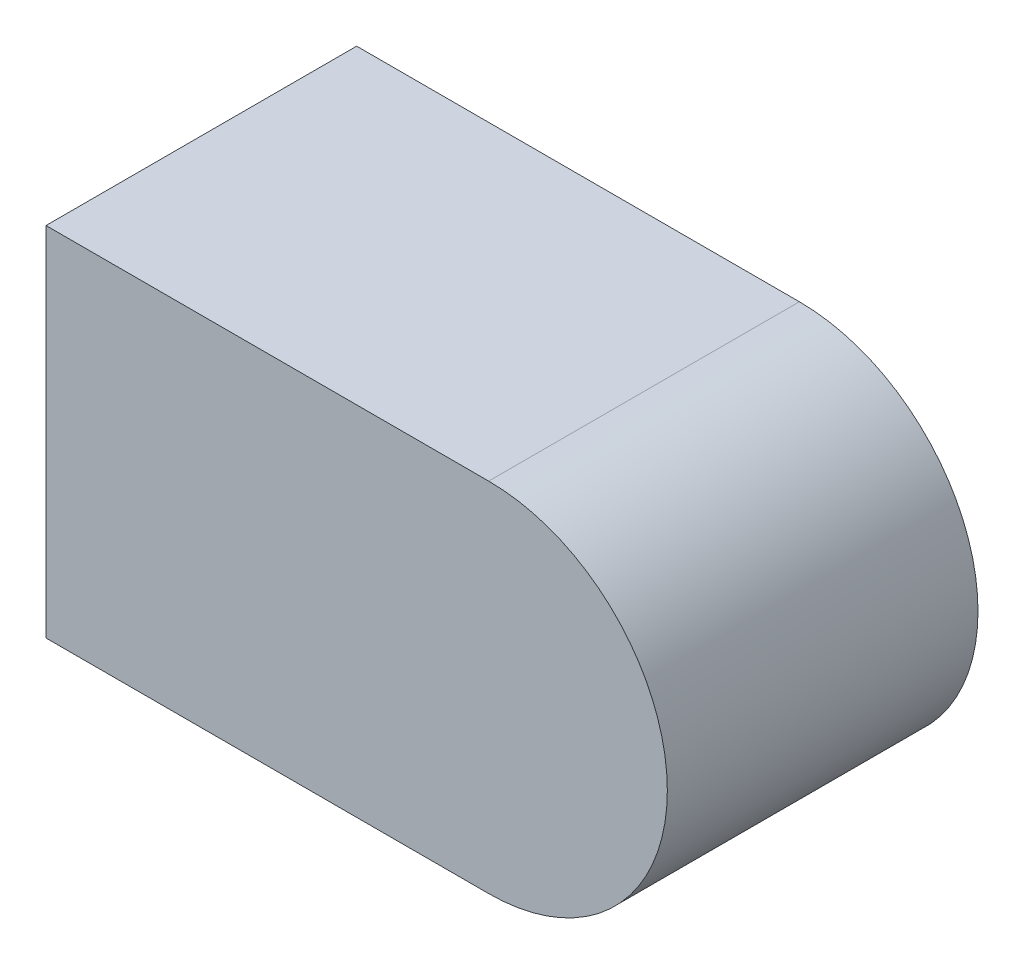
ISO-10303-21;
HEADER;
FILE_DESCRIPTION(('STEP AP214'),'2;1');
FILE_NAME('part.step','',(''),(''),'','','');
FILE_SCHEMA(('AUTOMOTIVE_DESIGN { 1 0 10303 214 1 1 1 1 }'));
ENDSEC;
DATA;
#1=APPLICATION_CONTEXT('core data for automotive mechanical design processes');
#2=APPLICATION_PROTOCOL_DEFINITION('international standard','automotive_design',2000,#1);
#3=PRODUCT_CONTEXT('',#1,'mechanical');
#4=PRODUCT('Part','Part','',(#3));
#5=PRODUCT_RELATED_PRODUCT_CATEGORY('part','',(#4));
#6=PRODUCT_DEFINITION_FORMATION('','',#4);
#7=PRODUCT_DEFINITION_CONTEXT('part definition',#1,'design');
#8=PRODUCT_DEFINITION('design','',#6,#7);
#9=PRODUCT_DEFINITION_SHAPE('','',#8);
#10=(LENGTH_UNIT() NAMED_UNIT(*) SI_UNIT(.MILLI.,.METRE.));
#11=(NAMED_UNIT(*) PLANE_ANGLE_UNIT() SI_UNIT($,.RADIAN.));
#12=(NAMED_UNIT(*) SI_UNIT($,.STERADIAN.) SOLID_ANGLE_UNIT());
#13=UNCERTAINTY_MEASURE_WITH_UNIT(LENGTH_MEASURE(1.E-05),#10,'distance_accuracy_value','');
#14=(GEOMETRIC_REPRESENTATION_CONTEXT(3) GLOBAL_UNCERTAINTY_ASSIGNED_CONTEXT((#13)) GLOBAL_UNIT_ASSIGNED_CONTEXT((#10,
#11,#12)) REPRESENTATION_CONTEXT('',''));
#15=CARTESIAN_POINT('',(0.,0.,0.));
#16=DIRECTION('',(0.,0.,1.));
#17=DIRECTION('',(1.,0.,0.));
#18=AXIS2_PLACEMENT_3D('',#15,#16,#17);
#19=CARTESIAN_POINT('',(-2.8335265642716,1.25,0.));
#20=DIRECTION('',(0.,0.,1.));
#21=DIRECTION('',(1.,0.,0.));
#22=AXIS2_PLACEMENT_3D('',#19,#20,#21);
#23=PLANE('',#22);
#24=DIRECTION('',(0.,-1.,0.));
#25=VECTOR('',#24,1.);
#26=CARTESIAN_POINT('',(-3.,1.365,0.));
#27=LINE('',#26,#25);
#28=CARTESIAN_POINT('',(-3.,1.365,0.));
#29=VERTEX_POINT('',#28);
#30=CARTESIAN_POINT('',(-3.,1.135,0.));
#31=VERTEX_POINT('',#30);
#32=EDGE_CURVE('E11',#29,#31,#27,.T.);
#33=ORIENTED_EDGE('',*,*,#32,.F.);
#34=DIRECTION('',(-1.,0.,0.));
#35=VECTOR('',#34,1.);
#36=CARTESIAN_POINT('',(-2.715,1.365,0.));
#37=LINE('',#36,#35);
#38=CARTESIAN_POINT('',(-2.715,1.365,0.));
#39=VERTEX_POINT('',#38);
#40=EDGE_CURVE('E24',#39,#29,#37,.T.);
#41=ORIENTED_EDGE('',*,*,#40,.F.);
#42=CARTESIAN_POINT('',(-2.715,1.25,0.));
#43=DIRECTION('',(0.,0.,1.));
#44=DIRECTION('',(0.,-1.,0.));
#45=AXIS2_PLACEMENT_3D('',#42,#43,#44);
#46=CIRCLE('',#45,0.115);
#47=CARTESIAN_POINT('',(-2.715,1.135,0.));
#48=VERTEX_POINT('',#47);
#49=EDGE_CURVE('E85',#48,#39,#46,.T.);
#50=ORIENTED_EDGE('',*,*,#49,.F.);
#51=DIRECTION('',(1.,0.,0.));
#52=VECTOR('',#51,1.);
#53=CARTESIAN_POINT('',(-3.,1.135,0.));
#54=LINE('',#53,#52);
#55=EDGE_CURVE('E82',#31,#48,#54,.T.);
#56=ORIENTED_EDGE('',*,*,#55,.F.);
#57=EDGE_LOOP('',(#33,#41,#50,#56));
#58=FACE_BOUND('',#57,.T.);
#59=ADVANCED_FACE('F17',(#58),#23,.F.);
#60=CARTESIAN_POINT('',(-3.,1.135,0.));
#61=DIRECTION('',(0.,-1.,0.));
#62=DIRECTION('',(1.,0.,0.));
#63=AXIS2_PLACEMENT_3D('',#60,#61,#62);
#64=PLANE('',#63);
#65=ORIENTED_EDGE('',*,*,#55,.T.);
#66=DIRECTION('',(0.,0.,1.));
#67=VECTOR('',#66,1.);
#68=CARTESIAN_POINT('',(-2.715,1.135,0.));
#69=LINE('',#68,#67);
#70=CARTESIAN_POINT('',(-2.715,1.135,0.2));
#71=VERTEX_POINT('',#70);
#72=EDGE_CURVE('E80',#48,#71,#69,.T.);
#73=ORIENTED_EDGE('',*,*,#72,.T.);
#74=DIRECTION('',(1.,0.,0.));
#75=VECTOR('',#74,1.);
#76=CARTESIAN_POINT('',(-3.,1.135,0.2));
#77=LINE('',#76,#75);
#78=CARTESIAN_POINT('',(-3.,1.135,0.2));
#79=VERTEX_POINT('',#78);
#80=EDGE_CURVE('E78',#79,#71,#77,.T.);
#81=ORIENTED_EDGE('',*,*,#80,.F.);
#82=DIRECTION('',(0.,0.,-1.));
#83=VECTOR('',#82,1.);
#84=CARTESIAN_POINT('',(-3.,1.135,0.));
#85=LINE('',#84,#83);
#86=EDGE_CURVE('E71',#79,#31,#85,.T.);
#87=ORIENTED_EDGE('',*,*,#86,.T.);
#88=EDGE_LOOP('',(#65,#73,#81,#87));
#89=FACE_BOUND('',#88,.T.);
#90=ADVANCED_FACE('F91',(#89),#64,.T.);
#91=CARTESIAN_POINT('',(-2.715,1.25,0.));
#92=DIRECTION('',(0.,0.,1.));
#93=DIRECTION('',(0.,-1.,0.));
#94=AXIS2_PLACEMENT_3D('',#91,#92,#93);
#95=CYLINDRICAL_SURFACE('',#94,0.115);
#96=ORIENTED_EDGE('',*,*,#49,.T.);
#97=DIRECTION('',(0.,0.,1.));
#98=VECTOR('',#97,1.);
#99=CARTESIAN_POINT('',(-2.715,1.365,0.));
#100=LINE('',#99,#98);
#101=CARTESIAN_POINT('',(-2.715,1.365,0.2));
#102=VERTEX_POINT('',#101);
#103=EDGE_CURVE('E75',#39,#102,#100,.T.);
#104=ORIENTED_EDGE('',*,*,#103,.T.);
#105=CARTESIAN_POINT('',(-2.715,1.25,0.2));
#106=DIRECTION('',(0.,0.,1.));
#107=DIRECTION('',(0.,-1.,0.));
#108=AXIS2_PLACEMENT_3D('',#105,#106,#107);
#109=CIRCLE('',#108,0.115);
#110=EDGE_CURVE('E59',#71,#102,#109,.T.);
#111=ORIENTED_EDGE('',*,*,#110,.F.);
#112=ORIENTED_EDGE('',*,*,#72,.F.);
#113=EDGE_LOOP('',(#96,#104,#111,#112));
#114=FACE_BOUND('',#113,.T.);
#115=ADVANCED_FACE('F89',(#114),#95,.T.);
#116=CARTESIAN_POINT('',(-2.715,1.365,0.));
#117=DIRECTION('',(0.,1.,0.));
#118=DIRECTION('',(-1.,0.,0.));
#119=AXIS2_PLACEMENT_3D('',#116,#117,#118);
#120=PLANE('',#119);
#121=ORIENTED_EDGE('',*,*,#40,.T.);
#122=DIRECTION('',(0.,0.,1.));
#123=VECTOR('',#122,1.);
#124=CARTESIAN_POINT('',(-3.,1.365,0.));
#125=LINE('',#124,#123);
#126=CARTESIAN_POINT('',(-3.,1.365,0.2));
#127=VERTEX_POINT('',#126);
#128=EDGE_CURVE('E53',#29,#127,#125,.T.);
#129=ORIENTED_EDGE('',*,*,#128,.T.);
#130=DIRECTION('',(-1.,0.,0.));
#131=VECTOR('',#130,1.);
#132=CARTESIAN_POINT('',(-2.715,1.365,0.2));
#133=LINE('',#132,#131);
#134=EDGE_CURVE('E57',#102,#127,#133,.T.);
#135=ORIENTED_EDGE('',*,*,#134,.F.);
#136=ORIENTED_EDGE('',*,*,#103,.F.);
#137=EDGE_LOOP('',(#121,#129,#135,#136));
#138=FACE_BOUND('',#137,.T.);
#139=ADVANCED_FACE('F55',(#138),#120,.T.);
#140=CARTESIAN_POINT('',(-3.,3.,0.));
#141=DIRECTION('',(-1.,0.,0.));
#142=DIRECTION('',(0.,-1.,0.));
#143=AXIS2_PLACEMENT_3D('',#140,#141,#142);
#144=PLANE('',#143);
#145=ORIENTED_EDGE('',*,*,#86,.F.);
#146=DIRECTION('',(0.,-1.,0.));
#147=VECTOR('',#146,1.);
#148=CARTESIAN_POINT('',(-3.,2.125,0.2));
#149=LINE('',#148,#147);
#150=EDGE_CURVE('E66',#127,#79,#149,.T.);
#151=ORIENTED_EDGE('',*,*,#150,.F.);
#152=ORIENTED_EDGE('',*,*,#128,.F.);
#153=ORIENTED_EDGE('',*,*,#32,.T.);
#154=EDGE_LOOP('',(#145,#151,#152,#153));
#155=FACE_BOUND('',#154,.T.);
#156=ADVANCED_FACE('F69',(#155),#144,.T.);
#157=CARTESIAN_POINT('',(-2.8335240809167,1.25,0.2));
#158=DIRECTION('',(0.,0.,1.));
#159=DIRECTION('',(1.,0.,0.));
#160=AXIS2_PLACEMENT_3D('',#157,#158,#159);
#161=PLANE('',#160);
#162=ORIENTED_EDGE('',*,*,#134,.T.);
#163=ORIENTED_EDGE('',*,*,#150,.T.);
#164=ORIENTED_EDGE('',*,*,#80,.T.);
#165=ORIENTED_EDGE('',*,*,#110,.T.);
#166=EDGE_LOOP('',(#162,#163,#164,#165));
#167=FACE_BOUND('',#166,.T.);
#168=ADVANCED_FACE('F64',(#167),#161,.T.);
#169=CLOSED_SHELL('',(#59,#90,#115,#139,#156,#168));
#170=MANIFOLD_SOLID_BREP('B1',#169);
#171=ADVANCED_BREP_SHAPE_REPRESENTATION('',(#18,#170),#14);
#172=SHAPE_DEFINITION_REPRESENTATION(#9,#171);
ENDSEC;
END-ISO-10303-21;
